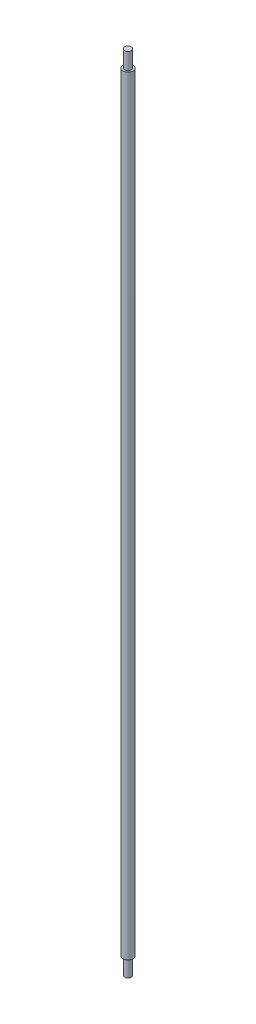
ISO-10303-21;
HEADER;
FILE_DESCRIPTION(('STEP AP214'),'2;1');
FILE_NAME('part.step','',(''),(''),'','','');
FILE_SCHEMA(('AUTOMOTIVE_DESIGN { 1 0 10303 214 1 1 1 1 }'));
ENDSEC;
DATA;
#1=APPLICATION_CONTEXT('core data for automotive mechanical design processes');
#2=APPLICATION_PROTOCOL_DEFINITION('international standard','automotive_design',2000,#1);
#3=PRODUCT_CONTEXT('',#1,'mechanical');
#4=PRODUCT('Part','Part','',(#3));
#5=PRODUCT_RELATED_PRODUCT_CATEGORY('part','',(#4));
#6=PRODUCT_DEFINITION_FORMATION('','',#4);
#7=PRODUCT_DEFINITION_CONTEXT('part definition',#1,'design');
#8=PRODUCT_DEFINITION('design','',#6,#7);
#9=PRODUCT_DEFINITION_SHAPE('','',#8);
#10=(LENGTH_UNIT() NAMED_UNIT(*) SI_UNIT(.MILLI.,.METRE.));
#11=(NAMED_UNIT(*) PLANE_ANGLE_UNIT() SI_UNIT($,.RADIAN.));
#12=(NAMED_UNIT(*) SI_UNIT($,.STERADIAN.) SOLID_ANGLE_UNIT());
#13=UNCERTAINTY_MEASURE_WITH_UNIT(LENGTH_MEASURE(1.E-05),#10,'distance_accuracy_value','');
#14=(GEOMETRIC_REPRESENTATION_CONTEXT(3) GLOBAL_UNCERTAINTY_ASSIGNED_CONTEXT((#13)) GLOBAL_UNIT_ASSIGNED_CONTEXT((#10,
#11,#12)) REPRESENTATION_CONTEXT('',''));
#15=CARTESIAN_POINT('',(0.,0.,0.));
#16=DIRECTION('',(0.,0.,1.));
#17=DIRECTION('',(1.,0.,0.));
#18=AXIS2_PLACEMENT_3D('',#15,#16,#17);
#19=CARTESIAN_POINT('',(0.,1200.,0.));
#20=DIRECTION('',(0.,-1.,0.));
#21=DIRECTION('',(0.,0.,-1.));
#22=AXIS2_PLACEMENT_3D('',#19,#20,#21);
#23=CYLINDRICAL_SURFACE('',#22,7.5);
#24=CARTESIAN_POINT('',(0.,1175.,0.));
#25=DIRECTION('',(0.,1.,0.));
#26=DIRECTION('',(0.,0.,1.));
#27=AXIS2_PLACEMENT_3D('',#24,#25,#26);
#28=CIRCLE('',#27,7.5);
#29=CARTESIAN_POINT('',(0.,1175.,7.5));
#30=VERTEX_POINT('',#29);
#31=EDGE_CURVE('E13',#30,#30,#28,.T.);
#32=ORIENTED_EDGE('',*,*,#31,.F.);
#33=EDGE_LOOP('',(#32));
#34=FACE_BOUND('',#33,.T.);
#35=CARTESIAN_POINT('',(0.,24.9999999999999,0.));
#36=DIRECTION('',(0.,-1.,0.));
#37=DIRECTION('',(0.,0.,-1.));
#38=AXIS2_PLACEMENT_3D('',#35,#36,#37);
#39=CIRCLE('',#38,7.5);
#40=CARTESIAN_POINT('',(0.,24.9999999999999,-7.5));
#41=VERTEX_POINT('',#40);
#42=EDGE_CURVE('E55',#41,#41,#39,.T.);
#43=ORIENTED_EDGE('',*,*,#42,.F.);
#44=EDGE_LOOP('',(#43));
#45=FACE_BOUND('',#44,.T.);
#46=ADVANCED_FACE('F52',(#34,#45),#23,.T.);
#47=CARTESIAN_POINT('',(0.,1175.,0.));
#48=DIRECTION('',(0.,1.,0.));
#49=DIRECTION('',(0.,0.,1.));
#50=AXIS2_PLACEMENT_3D('',#47,#48,#49);
#51=PLANE('',#50);
#52=CARTESIAN_POINT('',(0.,1175.,0.));
#53=DIRECTION('',(0.,1.,0.));
#54=DIRECTION('',(0.,0.,1.));
#55=AXIS2_PLACEMENT_3D('',#52,#53,#54);
#56=CIRCLE('',#55,5.);
#57=CARTESIAN_POINT('',(0.,1175.,5.));
#58=VERTEX_POINT('',#57);
#59=EDGE_CURVE('E59',#58,#58,#56,.T.);
#60=ORIENTED_EDGE('',*,*,#59,.F.);
#61=EDGE_LOOP('',(#60));
#62=FACE_BOUND('',#61,.T.);
#63=ORIENTED_EDGE('',*,*,#31,.T.);
#64=EDGE_LOOP('',(#63));
#65=FACE_BOUND('',#64,.T.);
#66=ADVANCED_FACE('F81',(#62,#65),#51,.T.);
#67=CARTESIAN_POINT('',(0.,1175.,0.));
#68=DIRECTION('',(0.,1.,0.));
#69=DIRECTION('',(0.,0.,1.));
#70=AXIS2_PLACEMENT_3D('',#67,#68,#69);
#71=CYLINDRICAL_SURFACE('',#70,5.);
#72=ORIENTED_EDGE('',*,*,#59,.T.);
#73=EDGE_LOOP('',(#72));
#74=FACE_BOUND('',#73,.T.);
#75=CARTESIAN_POINT('',(0.,1200.,0.));
#76=DIRECTION('',(0.,1.,0.));
#77=DIRECTION('',(0.,0.,1.));
#78=AXIS2_PLACEMENT_3D('',#75,#76,#77);
#79=CIRCLE('',#78,5.);
#80=CARTESIAN_POINT('',(0.,1200.,5.));
#81=VERTEX_POINT('',#80);
#82=EDGE_CURVE('E63',#81,#81,#79,.T.);
#83=ORIENTED_EDGE('',*,*,#82,.F.);
#84=EDGE_LOOP('',(#83));
#85=FACE_BOUND('',#84,.T.);
#86=ADVANCED_FACE('F86',(#74,#85),#71,.T.);
#87=CARTESIAN_POINT('',(0.,1200.,0.));
#88=DIRECTION('',(0.,1.,0.));
#89=DIRECTION('',(0.,0.,1.));
#90=AXIS2_PLACEMENT_3D('',#87,#88,#89);
#91=PLANE('',#90);
#92=ORIENTED_EDGE('',*,*,#82,.T.);
#93=EDGE_LOOP('',(#92));
#94=FACE_BOUND('',#93,.T.);
#95=ADVANCED_FACE('F92',(#94),#91,.T.);
#96=CARTESIAN_POINT('',(0.,25.,0.));
#97=DIRECTION('',(0.,-1.,0.));
#98=DIRECTION('',(0.,0.,-1.));
#99=AXIS2_PLACEMENT_3D('',#96,#97,#98);
#100=PLANE('',#99);
#101=CARTESIAN_POINT('',(0.,25.,0.));
#102=DIRECTION('',(0.,-1.,0.));
#103=DIRECTION('',(0.,0.,-1.));
#104=AXIS2_PLACEMENT_3D('',#101,#102,#103);
#105=CIRCLE('',#104,5.);
#106=CARTESIAN_POINT('',(0.,25.,-5.));
#107=VERTEX_POINT('',#106);
#108=EDGE_CURVE('E71',#107,#107,#105,.T.);
#109=ORIENTED_EDGE('',*,*,#108,.F.);
#110=EDGE_LOOP('',(#109));
#111=FACE_BOUND('',#110,.T.);
#112=ORIENTED_EDGE('',*,*,#42,.T.);
#113=EDGE_LOOP('',(#112));
#114=FACE_BOUND('',#113,.T.);
#115=ADVANCED_FACE('F78',(#111,#114),#100,.T.);
#116=CARTESIAN_POINT('',(0.,25.,0.));
#117=DIRECTION('',(0.,-1.,0.));
#118=DIRECTION('',(0.,0.,-1.));
#119=AXIS2_PLACEMENT_3D('',#116,#117,#118);
#120=CYLINDRICAL_SURFACE('',#119,5.);
#121=ORIENTED_EDGE('',*,*,#108,.T.);
#122=EDGE_LOOP('',(#121));
#123=FACE_BOUND('',#122,.T.);
#124=CARTESIAN_POINT('',(0.,0.,0.));
#125=DIRECTION('',(0.,-1.,0.));
#126=DIRECTION('',(0.,0.,-1.));
#127=AXIS2_PLACEMENT_3D('',#124,#125,#126);
#128=CIRCLE('',#127,5.);
#129=CARTESIAN_POINT('',(0.,0.,-5.));
#130=VERTEX_POINT('',#129);
#131=EDGE_CURVE('E68',#130,#130,#128,.T.);
#132=ORIENTED_EDGE('',*,*,#131,.F.);
#133=EDGE_LOOP('',(#132));
#134=FACE_BOUND('',#133,.T.);
#135=ADVANCED_FACE('F102',(#123,#134),#120,.T.);
#136=CARTESIAN_POINT('',(0.,0.,0.));
#137=DIRECTION('',(0.,1.,0.));
#138=DIRECTION('',(0.,0.,1.));
#139=AXIS2_PLACEMENT_3D('',#136,#137,#138);
#140=PLANE('',#139);
#141=ORIENTED_EDGE('',*,*,#131,.T.);
#142=EDGE_LOOP('',(#141));
#143=FACE_BOUND('',#142,.T.);
#144=ADVANCED_FACE('F100',(#143),#140,.F.);
#145=CLOSED_SHELL('',(#46,#66,#86,#95,#115,#135,#144));
#146=MANIFOLD_SOLID_BREP('B2',#145);
#147=ADVANCED_BREP_SHAPE_REPRESENTATION('',(#18,#146),#14);
#148=SHAPE_DEFINITION_REPRESENTATION(#9,#147);
ENDSEC;
END-ISO-10303-21;
